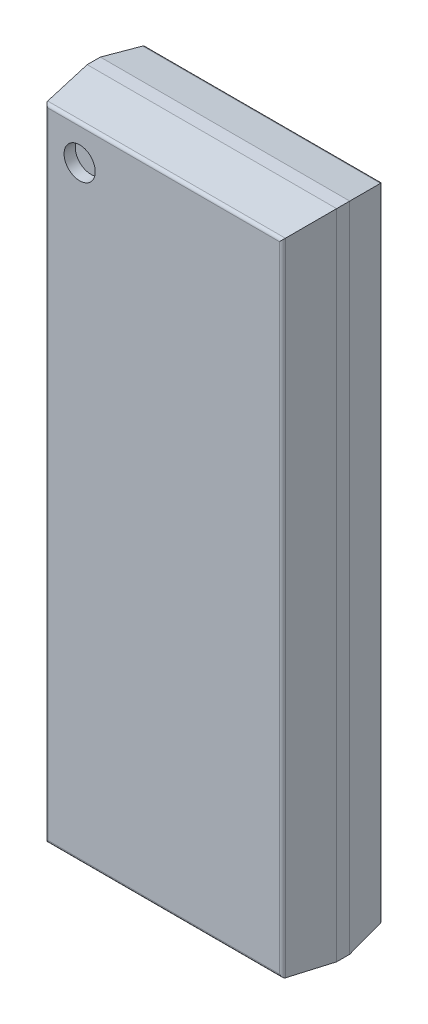
ISO-10303-21;
HEADER;
FILE_DESCRIPTION(('STEP AP214'),'2;1');
FILE_NAME('part.step','',(''),(''),'','','');
FILE_SCHEMA(('AUTOMOTIVE_DESIGN { 1 0 10303 214 1 1 1 1 }'));
ENDSEC;
DATA;
#1=APPLICATION_CONTEXT('core data for automotive mechanical design processes');
#2=APPLICATION_PROTOCOL_DEFINITION('international standard','automotive_design',2000,#1);
#3=PRODUCT_CONTEXT('',#1,'mechanical');
#4=PRODUCT('Part','Part','',(#3));
#5=PRODUCT_RELATED_PRODUCT_CATEGORY('part','',(#4));
#6=PRODUCT_DEFINITION_FORMATION('','',#4);
#7=PRODUCT_DEFINITION_CONTEXT('part definition',#1,'design');
#8=PRODUCT_DEFINITION('design','',#6,#7);
#9=PRODUCT_DEFINITION_SHAPE('','',#8);
#10=(LENGTH_UNIT() NAMED_UNIT(*) SI_UNIT(.MILLI.,.METRE.));
#11=(NAMED_UNIT(*) PLANE_ANGLE_UNIT() SI_UNIT($,.RADIAN.));
#12=(NAMED_UNIT(*) SI_UNIT($,.STERADIAN.) SOLID_ANGLE_UNIT());
#13=UNCERTAINTY_MEASURE_WITH_UNIT(LENGTH_MEASURE(1.E-05),#10,'distance_accuracy_value','');
#14=(GEOMETRIC_REPRESENTATION_CONTEXT(3) GLOBAL_UNCERTAINTY_ASSIGNED_CONTEXT((#13)) GLOBAL_UNIT_ASSIGNED_CONTEXT((#10,
#11,#12)) REPRESENTATION_CONTEXT('',''));
#15=CARTESIAN_POINT('',(0.,0.,0.));
#16=DIRECTION('',(0.,0.,1.));
#17=DIRECTION('',(1.,0.,0.));
#18=AXIS2_PLACEMENT_3D('',#15,#16,#17);
#19=CARTESIAN_POINT('',(-1.315,4.465,1.575));
#20=DIRECTION('',(0.,0.,1.));
#21=DIRECTION('',(1.,0.,0.));
#22=AXIS2_PLACEMENT_3D('',#19,#20,#21);
#23=PLANE('',#22);
#24=CARTESIAN_POINT('',(-1.315,4.465,1.575));
#25=DIRECTION('',(0.,0.,1.));
#26=DIRECTION('',(1.,0.,0.));
#27=AXIS2_PLACEMENT_3D('',#24,#25,#26);
#28=CIRCLE('',#27,0.24375);
#29=CARTESIAN_POINT('',(-1.07125,4.465,1.575));
#30=VERTEX_POINT('',#29);
#31=EDGE_CURVE('E11',#30,#30,#28,.T.);
#32=ORIENTED_EDGE('',*,*,#31,.T.);
#33=EDGE_LOOP('',(#32));
#34=FACE_BOUND('',#33,.T.);
#35=ADVANCED_FACE('F17',(#34),#23,.T.);
#36=CARTESIAN_POINT('',(-1.315,4.465,1.575));
#37=DIRECTION('',(0.,0.,1.));
#38=DIRECTION('',(1.,0.,0.));
#39=AXIS2_PLACEMENT_3D('',#36,#37,#38);
#40=CYLINDRICAL_SURFACE('',#39,0.24375);
#41=DIRECTION('',(0.,0.,1.));
#42=VECTOR('',#41,1.);
#43=CARTESIAN_POINT('',(-1.07125,4.465,1.575));
#44=LINE('',#43,#42);
#45=CARTESIAN_POINT('',(-1.07125,4.465,1.75));
#46=VERTEX_POINT('',#45);
#47=EDGE_CURVE('E20',#30,#46,#44,.T.);
#48=ORIENTED_EDGE('',*,*,#47,.T.);
#49=CARTESIAN_POINT('',(-1.315,4.465,1.75));
#50=DIRECTION('',(0.,0.,1.));
#51=DIRECTION('',(1.,0.,0.));
#52=AXIS2_PLACEMENT_3D('',#49,#50,#51);
#53=CIRCLE('',#52,0.24375);
#54=EDGE_CURVE('E323',#46,#46,#53,.T.);
#55=ORIENTED_EDGE('',*,*,#54,.T.);
#56=ORIENTED_EDGE('',*,*,#47,.F.);
#57=ORIENTED_EDGE('',*,*,#31,.F.);
#58=EDGE_LOOP('',(#48,#55,#56,#57));
#59=FACE_BOUND('',#58,.T.);
#60=ADVANCED_FACE('F570',(#59),#40,.F.);
#61=CARTESIAN_POINT('',(1.808558552786,-5.0025,1.7));
#62=DIRECTION('',(0.,1.,0.));
#63=DIRECTION('',(0.,0.,1.));
#64=AXIS2_PLACEMENT_3D('',#61,#62,#63);
#65=CYLINDRICAL_SURFACE('',#64,0.05);
#66=CARTESIAN_POINT('',(1.808558552786,-4.958558552786,1.7));
#67=DIRECTION('',(-0.707106781186548,-0.707106781186548,0.));
#68=DIRECTION('',(0.707106781186548,-0.707106781186548,0.));
#69=AXIS2_PLACEMENT_3D('',#66,#67,#68);
#70=ELLIPSE('',#69,0.07071067811865,0.05);
#71=CARTESIAN_POINT('',(1.858144342698,-5.008144342698,1.706422572601));
#72=VERTEX_POINT('',#71);
#73=CARTESIAN_POINT('',(1.808558552786,-4.958558552786,1.75));
#74=VERTEX_POINT('',#73);
#75=EDGE_CURVE('E313',#72,#74,#70,.T.);
#76=ORIENTED_EDGE('',*,*,#75,.F.);
#77=DIRECTION('',(0.,1.,0.));
#78=VECTOR('',#77,1.);
#79=CARTESIAN_POINT('',(1.858144342698,-5.0025,1.706422572601));
#80=LINE('',#79,#78);
#81=CARTESIAN_POINT('',(1.858144342698,5.008144342698,1.706422572601));
#82=VERTEX_POINT('',#81);
#83=EDGE_CURVE('E309',#72,#82,#80,.T.);
#84=ORIENTED_EDGE('',*,*,#83,.T.);
#85=CARTESIAN_POINT('',(1.808558552786,4.958558552786,1.7));
#86=DIRECTION('',(-0.707106781186548,0.707106781186548,0.));
#87=DIRECTION('',(0.707106781186548,0.707106781186548,0.));
#88=AXIS2_PLACEMENT_3D('',#85,#86,#87);
#89=ELLIPSE('',#88,0.07071067811865,0.05);
#90=CARTESIAN_POINT('',(1.808558552786,4.958558552786,1.75));
#91=VERTEX_POINT('',#90);
#92=EDGE_CURVE('E325',#91,#82,#89,.T.);
#93=ORIENTED_EDGE('',*,*,#92,.F.);
#94=DIRECTION('',(0.,1.,0.));
#95=VECTOR('',#94,1.);
#96=CARTESIAN_POINT('',(1.808558552786,-5.0025,1.75));
#97=LINE('',#96,#95);
#98=EDGE_CURVE('E270',#74,#91,#97,.T.);
#99=ORIENTED_EDGE('',*,*,#98,.F.);
#100=EDGE_LOOP('',(#76,#84,#93,#99));
#101=FACE_BOUND('',#100,.T.);
#102=ADVANCED_FACE('F562',(#101),#65,.T.);
#103=CARTESIAN_POINT('',(-1.8525,4.958558552786,1.7));
#104=DIRECTION('',(1.,0.,0.));
#105=DIRECTION('',(0.,0.,1.));
#106=AXIS2_PLACEMENT_3D('',#103,#104,#105);
#107=CYLINDRICAL_SURFACE('',#106,0.05);
#108=DIRECTION('',(1.,0.,0.));
#109=VECTOR('',#108,1.);
#110=CARTESIAN_POINT('',(-1.8525,4.958558552786,1.75));
#111=LINE('',#110,#109);
#112=CARTESIAN_POINT('',(-1.808558552786,4.958558552786,1.75));
#113=VERTEX_POINT('',#112);
#114=EDGE_CURVE('E274',#113,#91,#111,.T.);
#115=ORIENTED_EDGE('',*,*,#114,.T.);
#116=ORIENTED_EDGE('',*,*,#92,.T.);
#117=DIRECTION('',(1.,0.,0.));
#118=VECTOR('',#117,1.);
#119=CARTESIAN_POINT('',(-1.8525,5.008144342698,1.706422572601));
#120=LINE('',#119,#118);
#121=CARTESIAN_POINT('',(-1.858144342698,5.008144342698,1.706422572601));
#122=VERTEX_POINT('',#121);
#123=EDGE_CURVE('E301',#122,#82,#120,.T.);
#124=ORIENTED_EDGE('',*,*,#123,.F.);
#125=CARTESIAN_POINT('',(-1.808558552786,4.958558552786,1.7));
#126=DIRECTION('',(0.707106781186548,0.707106781186548,0.));
#127=DIRECTION('',(-0.707106781186548,0.707106781186548,0.));
#128=AXIS2_PLACEMENT_3D('',#125,#126,#127);
#129=ELLIPSE('',#128,0.07071067811865,0.05);
#130=EDGE_CURVE('E297',#122,#113,#129,.T.);
#131=ORIENTED_EDGE('',*,*,#130,.T.);
#132=EDGE_LOOP('',(#115,#116,#124,#131));
#133=FACE_BOUND('',#132,.T.);
#134=ADVANCED_FACE('F551',(#133),#107,.T.);
#135=CARTESIAN_POINT('',(-1.95,-5.1,1.75));
#136=DIRECTION('',(0.,0.,1.));
#137=DIRECTION('',(1.,0.,0.));
#138=AXIS2_PLACEMENT_3D('',#135,#136,#137);
#139=PLANE('',#138);
#140=ORIENTED_EDGE('',*,*,#54,.F.);
#141=EDGE_LOOP('',(#140));
#142=FACE_BOUND('',#141,.T.);
#143=DIRECTION('',(0.,1.,0.));
#144=VECTOR('',#143,1.);
#145=CARTESIAN_POINT('',(-1.808558552786,-5.0025,1.75));
#146=LINE('',#145,#144);
#147=CARTESIAN_POINT('',(-1.808558552786,-4.958558552786,1.75));
#148=VERTEX_POINT('',#147);
#149=EDGE_CURVE('E203',#148,#113,#146,.T.);
#150=ORIENTED_EDGE('',*,*,#149,.F.);
#151=DIRECTION('',(1.,0.,0.));
#152=VECTOR('',#151,1.);
#153=CARTESIAN_POINT('',(-1.8525,-4.958558552786,1.75));
#154=LINE('',#153,#152);
#155=EDGE_CURVE('E275',#148,#74,#154,.T.);
#156=ORIENTED_EDGE('',*,*,#155,.T.);
#157=ORIENTED_EDGE('',*,*,#98,.T.);
#158=ORIENTED_EDGE('',*,*,#114,.F.);
#159=EDGE_LOOP('',(#150,#156,#157,#158));
#160=FACE_BOUND('',#159,.T.);
#161=ADVANCED_FACE('F539',(#142,#160),#139,.T.);
#162=CARTESIAN_POINT('',(-1.8525,-4.958558552786,1.7));
#163=DIRECTION('',(1.,0.,0.));
#164=DIRECTION('',(0.,-0.991715798237691,0.12845145201896));
#165=AXIS2_PLACEMENT_3D('',#162,#163,#164);
#166=CYLINDRICAL_SURFACE('',#165,0.05);
#167=DIRECTION('',(1.,0.,0.));
#168=VECTOR('',#167,1.);
#169=CARTESIAN_POINT('',(-1.8525,-5.008144342698,1.706422572601));
#170=LINE('',#169,#168);
#171=CARTESIAN_POINT('',(-1.858144342698,-5.008144342698,1.706422572601));
#172=VERTEX_POINT('',#171);
#173=EDGE_CURVE('E204',#172,#72,#170,.T.);
#174=ORIENTED_EDGE('',*,*,#173,.T.);
#175=ORIENTED_EDGE('',*,*,#75,.T.);
#176=ORIENTED_EDGE('',*,*,#155,.F.);
#177=CARTESIAN_POINT('',(-1.808558552786,-4.958558552786,1.7));
#178=DIRECTION('',(-0.707106781186548,0.707106781186548,0.));
#179=DIRECTION('',(0.707106781186548,0.707106781186548,0.));
#180=AXIS2_PLACEMENT_3D('',#177,#178,#179);
#181=ELLIPSE('',#180,0.07071067811865,0.05);
#182=EDGE_CURVE('E199',#172,#148,#181,.T.);
#183=ORIENTED_EDGE('',*,*,#182,.F.);
#184=EDGE_LOOP('',(#174,#175,#176,#183));
#185=FACE_BOUND('',#184,.T.);
#186=ADVANCED_FACE('F528',(#185),#166,.T.);
#187=CARTESIAN_POINT('',(1.90125,-5.1,1.373623210137));
#188=DIRECTION('',(0.991715798237691,0.,0.12845145201896));
#189=DIRECTION('',(0.,-1.,0.));
#190=AXIS2_PLACEMENT_3D('',#187,#188,#189);
#191=PLANE('',#190);
#192=DIRECTION('',(-0.12740467794397,0.12740467794397,0.983634127140771));
#193=VECTOR('',#192,1.);
#194=CARTESIAN_POINT('',(1.870389001332,-5.020389001332,1.611887079072));
#195=LINE('',#194,#193);
#196=CARTESIAN_POINT('',(1.95,-5.1,0.997246420274));
#197=VERTEX_POINT('',#196);
#198=EDGE_CURVE('E287',#197,#72,#195,.T.);
#199=ORIENTED_EDGE('',*,*,#198,.F.);
#200=DIRECTION('',(0.,1.,0.));
#201=VECTOR('',#200,1.);
#202=CARTESIAN_POINT('',(1.95,-5.1,0.997246420274));
#203=LINE('',#202,#201);
#204=CARTESIAN_POINT('',(1.95,5.1,0.997246420274));
#205=VERTEX_POINT('',#204);
#206=EDGE_CURVE('E283',#197,#205,#203,.T.);
#207=ORIENTED_EDGE('',*,*,#206,.T.);
#208=DIRECTION('',(-0.12740467794397,-0.12740467794397,0.983634127140771));
#209=VECTOR('',#208,1.);
#210=CARTESIAN_POINT('',(1.787606046326,4.937606046326,2.251016983906));
#211=LINE('',#210,#209);
#212=EDGE_CURVE('E305',#205,#82,#211,.T.);
#213=ORIENTED_EDGE('',*,*,#212,.T.);
#214=ORIENTED_EDGE('',*,*,#83,.F.);
#215=EDGE_LOOP('',(#199,#207,#213,#214));
#216=FACE_BOUND('',#215,.T.);
#217=ADVANCED_FACE('F518',(#216),#191,.T.);
#218=CARTESIAN_POINT('',(-1.95,5.05125,1.373623210137));
#219=DIRECTION('',(0.,0.991715798237691,0.12845145201896));
#220=DIRECTION('',(1.,0.,0.));
#221=AXIS2_PLACEMENT_3D('',#218,#219,#220);
#222=PLANE('',#221);
#223=ORIENTED_EDGE('',*,*,#123,.T.);
#224=ORIENTED_EDGE('',*,*,#212,.F.);
#225=DIRECTION('',(1.,0.,0.));
#226=VECTOR('',#225,1.);
#227=CARTESIAN_POINT('',(-1.95,5.1,0.997246420274));
#228=LINE('',#227,#226);
#229=CARTESIAN_POINT('',(-1.95,5.1,0.997246420274));
#230=VERTEX_POINT('',#229);
#231=EDGE_CURVE('E279',#230,#205,#228,.T.);
#232=ORIENTED_EDGE('',*,*,#231,.F.);
#233=DIRECTION('',(0.12740467794397,-0.12740467794397,0.983634127140771));
#234=VECTOR('',#233,1.);
#235=CARTESIAN_POINT('',(-1.819258352652,4.969258352652,2.006643784999));
#236=LINE('',#235,#234);
#237=EDGE_CURVE('E261',#230,#122,#236,.T.);
#238=ORIENTED_EDGE('',*,*,#237,.T.);
#239=EDGE_LOOP('',(#223,#224,#232,#238));
#240=FACE_BOUND('',#239,.T.);
#241=ADVANCED_FACE('F507',(#240),#222,.T.);
#242=CARTESIAN_POINT('',(-1.808558552786,-5.0025,1.7));
#243=DIRECTION('',(0.,1.,0.));
#244=DIRECTION('',(-0.991715798237691,0.,0.12845145201896));
#245=AXIS2_PLACEMENT_3D('',#242,#243,#244);
#246=CYLINDRICAL_SURFACE('',#245,0.05);
#247=ORIENTED_EDGE('',*,*,#182,.T.);
#248=ORIENTED_EDGE('',*,*,#149,.T.);
#249=ORIENTED_EDGE('',*,*,#130,.F.);
#250=DIRECTION('',(0.,1.,0.));
#251=VECTOR('',#250,1.);
#252=CARTESIAN_POINT('',(-1.858144342698,-5.0025,1.706422572601));
#253=LINE('',#252,#251);
#254=EDGE_CURVE('E257',#172,#122,#253,.T.);
#255=ORIENTED_EDGE('',*,*,#254,.F.);
#256=EDGE_LOOP('',(#247,#248,#249,#255));
#257=FACE_BOUND('',#256,.T.);
#258=ADVANCED_FACE('F497',(#257),#246,.T.);
#259=CARTESIAN_POINT('',(-1.95,-5.05125,1.373623210137));
#260=DIRECTION('',(0.,0.991715798237691,-0.12845145201896));
#261=DIRECTION('',(-1.,0.,0.));
#262=AXIS2_PLACEMENT_3D('',#259,#260,#261);
#263=PLANE('',#262);
#264=DIRECTION('',(0.12740467794397,0.12740467794397,0.983634127140771));
#265=VECTOR('',#264,1.);
#266=CARTESIAN_POINT('',(-1.902041307658,-5.052041307658,1.367513880164));
#267=LINE('',#266,#265);
#268=CARTESIAN_POINT('',(-1.95,-5.1,0.997246420274));
#269=VERTEX_POINT('',#268);
#270=EDGE_CURVE('E265',#269,#172,#267,.T.);
#271=ORIENTED_EDGE('',*,*,#270,.F.);
#272=DIRECTION('',(1.,0.,0.));
#273=VECTOR('',#272,1.);
#274=CARTESIAN_POINT('',(-1.95,-5.1,0.997246420274));
#275=LINE('',#274,#273);
#276=EDGE_CURVE('E149',#269,#197,#275,.T.);
#277=ORIENTED_EDGE('',*,*,#276,.T.);
#278=ORIENTED_EDGE('',*,*,#198,.T.);
#279=ORIENTED_EDGE('',*,*,#173,.F.);
#280=EDGE_LOOP('',(#271,#277,#278,#279));
#281=FACE_BOUND('',#280,.T.);
#282=ADVANCED_FACE('F487',(#281),#263,.F.);
#283=CARTESIAN_POINT('',(1.95,-5.1,0.18));
#284=DIRECTION('',(1.,0.,0.));
#285=DIRECTION('',(0.,1.,0.));
#286=AXIS2_PLACEMENT_3D('',#283,#284,#285);
#287=PLANE('',#286);
#288=DIRECTION('',(0.,0.,1.));
#289=VECTOR('',#288,1.);
#290=CARTESIAN_POINT('',(1.95,-5.1,0.18));
#291=LINE('',#290,#289);
#292=CARTESIAN_POINT('',(1.95,-5.1,0.792246420274));
#293=VERTEX_POINT('',#292);
#294=EDGE_CURVE('E235',#293,#197,#291,.T.);
#295=ORIENTED_EDGE('',*,*,#294,.F.);
#296=DIRECTION('',(0.,1.,0.));
#297=VECTOR('',#296,1.);
#298=CARTESIAN_POINT('',(1.95,-5.1,0.792246420274));
#299=LINE('',#298,#297);
#300=CARTESIAN_POINT('',(1.95,5.1,0.792246420274));
#301=VERTEX_POINT('',#300);
#302=EDGE_CURVE('E242',#293,#301,#299,.T.);
#303=ORIENTED_EDGE('',*,*,#302,.T.);
#304=DIRECTION('',(0.,0.,1.));
#305=VECTOR('',#304,1.);
#306=CARTESIAN_POINT('',(1.95,5.1,0.18));
#307=LINE('',#306,#305);
#308=EDGE_CURVE('E269',#301,#205,#307,.T.);
#309=ORIENTED_EDGE('',*,*,#308,.T.);
#310=ORIENTED_EDGE('',*,*,#206,.F.);
#311=EDGE_LOOP('',(#295,#303,#309,#310));
#312=FACE_BOUND('',#311,.T.);
#313=ADVANCED_FACE('F476',(#312),#287,.T.);
#314=CARTESIAN_POINT('',(1.809832438814,-5.0025,0.23));
#315=DIRECTION('',(0.,1.,0.));
#316=DIRECTION('',(0.,0.,-1.));
#317=AXIS2_PLACEMENT_3D('',#314,#315,#316);
#318=CYLINDRICAL_SURFACE('',#317,0.05);
#319=DIRECTION('',(0.,1.,0.));
#320=VECTOR('',#319,1.);
#321=CARTESIAN_POINT('',(1.809832438814,-5.0025,0.18));
#322=LINE('',#321,#320);
#323=CARTESIAN_POINT('',(1.809832438814,-4.959832438814,0.18));
#324=VERTEX_POINT('',#323);
#325=CARTESIAN_POINT('',(1.809832438814,4.959832438814,0.18));
#326=VERTEX_POINT('',#325);
#327=EDGE_CURVE('E250',#324,#326,#322,.T.);
#328=ORIENTED_EDGE('',*,*,#327,.T.);
#329=CARTESIAN_POINT('',(1.809832438814,4.959832438814,0.23));
#330=DIRECTION('',(0.707106781186548,-0.707106781186548,0.));
#331=DIRECTION('',(0.707106781186548,0.707106781186548,0.));
#332=AXIS2_PLACEMENT_3D('',#329,#330,#331);
#333=ELLIPSE('',#332,0.07071067811865,0.05);
#334=CARTESIAN_POINT('',(1.859210237675,5.009210237675,0.222136605083));
#335=VERTEX_POINT('',#334);
#336=EDGE_CURVE('E254',#326,#335,#333,.T.);
#337=ORIENTED_EDGE('',*,*,#336,.T.);
#338=DIRECTION('',(0.,1.,0.));
#339=VECTOR('',#338,1.);
#340=CARTESIAN_POINT('',(1.859210237675,-5.0025,0.222136605083));
#341=LINE('',#340,#339);
#342=CARTESIAN_POINT('',(1.859210237675,-5.009210237675,0.222136605083));
#343=VERTEX_POINT('',#342);
#344=EDGE_CURVE('E238',#343,#335,#341,.T.);
#345=ORIENTED_EDGE('',*,*,#344,.F.);
#346=CARTESIAN_POINT('',(1.809832438814,-4.959832438814,0.23));
#347=DIRECTION('',(0.707106781186548,0.707106781186548,0.));
#348=DIRECTION('',(0.707106781186548,-0.707106781186548,0.));
#349=AXIS2_PLACEMENT_3D('',#346,#347,#348);
#350=ELLIPSE('',#349,0.07071067811865,0.05);
#351=EDGE_CURVE('E229',#343,#324,#350,.T.);
#352=ORIENTED_EDGE('',*,*,#351,.T.);
#353=EDGE_LOOP('',(#328,#337,#345,#352));
#354=FACE_BOUND('',#353,.T.);
#355=ADVANCED_FACE('F464',(#354),#318,.T.);
#356=CARTESIAN_POINT('',(-1.95,5.1,0.18));
#357=DIRECTION('',(0.,1.,0.));
#358=DIRECTION('',(1.,0.,0.));
#359=AXIS2_PLACEMENT_3D('',#356,#357,#358);
#360=PLANE('',#359);
#361=ORIENTED_EDGE('',*,*,#308,.F.);
#362=DIRECTION('',(1.,0.,0.));
#363=VECTOR('',#362,1.);
#364=CARTESIAN_POINT('',(-1.95,5.1,0.792246420274));
#365=LINE('',#364,#363);
#366=CARTESIAN_POINT('',(-1.95,5.1,0.792246420274));
#367=VERTEX_POINT('',#366);
#368=EDGE_CURVE('E155',#367,#301,#365,.T.);
#369=ORIENTED_EDGE('',*,*,#368,.F.);
#370=DIRECTION('',(0.,0.,1.));
#371=VECTOR('',#370,1.);
#372=CARTESIAN_POINT('',(-1.95,5.1,0.18));
#373=LINE('',#372,#371);
#374=EDGE_CURVE('E156',#367,#230,#373,.T.);
#375=ORIENTED_EDGE('',*,*,#374,.T.);
#376=ORIENTED_EDGE('',*,*,#231,.T.);
#377=EDGE_LOOP('',(#361,#369,#375,#376));
#378=FACE_BOUND('',#377,.T.);
#379=ADVANCED_FACE('F454',(#378),#360,.T.);
#380=CARTESIAN_POINT('',(-1.90125,-5.1,1.373623210137));
#381=DIRECTION('',(0.991715798237691,0.,-0.12845145201896));
#382=DIRECTION('',(0.,-1.,0.));
#383=AXIS2_PLACEMENT_3D('',#380,#381,#382);
#384=PLANE('',#383);
#385=ORIENTED_EDGE('',*,*,#254,.T.);
#386=ORIENTED_EDGE('',*,*,#237,.F.);
#387=DIRECTION('',(0.,1.,0.));
#388=VECTOR('',#387,1.);
#389=CARTESIAN_POINT('',(-1.95,-5.1,0.997246420274));
#390=LINE('',#389,#388);
#391=EDGE_CURVE('E197',#269,#230,#390,.T.);
#392=ORIENTED_EDGE('',*,*,#391,.F.);
#393=ORIENTED_EDGE('',*,*,#270,.T.);
#394=EDGE_LOOP('',(#385,#386,#392,#393));
#395=FACE_BOUND('',#394,.T.);
#396=ADVANCED_FACE('F444',(#395),#384,.F.);
#397=CARTESIAN_POINT('',(-1.8525,4.959832438814,0.23));
#398=DIRECTION('',(1.,0.,0.));
#399=DIRECTION('',(0.,0.,-1.));
#400=AXIS2_PLACEMENT_3D('',#397,#398,#399);
#401=CYLINDRICAL_SURFACE('',#400,0.05);
#402=CARTESIAN_POINT('',(-1.809832438814,4.959832438814,0.23));
#403=DIRECTION('',(-0.707106781186548,-0.707106781186548,0.));
#404=DIRECTION('',(-0.707106781186548,0.707106781186548,0.));
#405=AXIS2_PLACEMENT_3D('',#402,#403,#404);
#406=ELLIPSE('',#405,0.07071067811865,0.05);
#407=CARTESIAN_POINT('',(-1.859210237675,5.009210237675,0.222136605083));
#408=VERTEX_POINT('',#407);
#409=CARTESIAN_POINT('',(-1.809832438814,4.959832438814,0.18));
#410=VERTEX_POINT('',#409);
#411=EDGE_CURVE('E167',#408,#410,#406,.T.);
#412=ORIENTED_EDGE('',*,*,#411,.F.);
#413=DIRECTION('',(1.,0.,0.));
#414=VECTOR('',#413,1.);
#415=CARTESIAN_POINT('',(-1.8525,5.009210237675,0.222136605083));
#416=LINE('',#415,#414);
#417=EDGE_CURVE('E224',#408,#335,#416,.T.);
#418=ORIENTED_EDGE('',*,*,#417,.T.);
#419=ORIENTED_EDGE('',*,*,#336,.F.);
#420=DIRECTION('',(1.,0.,0.));
#421=VECTOR('',#420,1.);
#422=CARTESIAN_POINT('',(-1.8525,4.959832438814,0.18));
#423=LINE('',#422,#421);
#424=EDGE_CURVE('E246',#410,#326,#423,.T.);
#425=ORIENTED_EDGE('',*,*,#424,.F.);
#426=EDGE_LOOP('',(#412,#418,#419,#425));
#427=FACE_BOUND('',#426,.T.);
#428=ADVANCED_FACE('F433',(#427),#401,.T.);
#429=CARTESIAN_POINT('',(-1.95,-5.1,0.18));
#430=DIRECTION('',(0.,0.,1.));
#431=DIRECTION('',(1.,0.,0.));
#432=AXIS2_PLACEMENT_3D('',#429,#430,#431);
#433=PLANE('',#432);
#434=ORIENTED_EDGE('',*,*,#424,.T.);
#435=ORIENTED_EDGE('',*,*,#327,.F.);
#436=DIRECTION('',(1.,0.,0.));
#437=VECTOR('',#436,1.);
#438=CARTESIAN_POINT('',(-1.8525,-4.959832438814,0.18));
#439=LINE('',#438,#437);
#440=CARTESIAN_POINT('',(-1.809832438814,-4.959832438814,0.18));
#441=VERTEX_POINT('',#440);
#442=EDGE_CURVE('E225',#441,#324,#439,.T.);
#443=ORIENTED_EDGE('',*,*,#442,.F.);
#444=DIRECTION('',(0.,1.,0.));
#445=VECTOR('',#444,1.);
#446=CARTESIAN_POINT('',(-1.809832438814,-5.0025,0.18));
#447=LINE('',#446,#445);
#448=EDGE_CURVE('E198',#441,#410,#447,.T.);
#449=ORIENTED_EDGE('',*,*,#448,.T.);
#450=EDGE_LOOP('',(#434,#435,#443,#449));
#451=FACE_BOUND('',#450,.T.);
#452=ADVANCED_FACE('F421',(#451),#433,.F.);
#453=CARTESIAN_POINT('',(1.90125,-5.1,0.486123210137));
#454=DIRECTION('',(-0.987555977225231,0.,0.157267898335037));
#455=DIRECTION('',(0.,1.,0.));
#456=AXIS2_PLACEMENT_3D('',#453,#454,#455);
#457=PLANE('',#456);
#458=ORIENTED_EDGE('',*,*,#344,.T.);
#459=DIRECTION('',(-0.15535837904697,-0.15535837904697,-0.975565245444812));
#460=VECTOR('',#459,1.);
#461=CARTESIAN_POINT('',(1.732266248138,4.882266248138,-0.575001888963));
#462=LINE('',#461,#460);
#463=EDGE_CURVE('E220',#301,#335,#462,.T.);
#464=ORIENTED_EDGE('',*,*,#463,.F.);
#465=ORIENTED_EDGE('',*,*,#302,.F.);
#466=DIRECTION('',(-0.15535837904697,0.15535837904697,-0.975565245444812));
#467=VECTOR('',#466,1.);
#468=CARTESIAN_POINT('',(1.855361000432,-5.005361000432,0.197965510489));
#469=LINE('',#468,#467);
#470=EDGE_CURVE('E165',#293,#343,#469,.T.);
#471=ORIENTED_EDGE('',*,*,#470,.T.);
#472=EDGE_LOOP('',(#458,#464,#465,#471));
#473=FACE_BOUND('',#472,.T.);
#474=ADVANCED_FACE('F411',(#473),#457,.F.);
#475=CARTESIAN_POINT('',(-1.95,-5.1,0.18));
#476=DIRECTION('',(0.,1.,0.));
#477=DIRECTION('',(1.,0.,0.));
#478=AXIS2_PLACEMENT_3D('',#475,#476,#477);
#479=PLANE('',#478);
#480=ORIENTED_EDGE('',*,*,#276,.F.);
#481=DIRECTION('',(0.,0.,1.));
#482=VECTOR('',#481,1.);
#483=CARTESIAN_POINT('',(-1.95,-5.1,0.18));
#484=LINE('',#483,#482);
#485=CARTESIAN_POINT('',(-1.95,-5.1,0.792246420274));
#486=VERTEX_POINT('',#485);
#487=EDGE_CURVE('E142',#486,#269,#484,.T.);
#488=ORIENTED_EDGE('',*,*,#487,.F.);
#489=DIRECTION('',(1.,0.,0.));
#490=VECTOR('',#489,1.);
#491=CARTESIAN_POINT('',(-1.95,-5.1,0.792246420274));
#492=LINE('',#491,#490);
#493=EDGE_CURVE('E146',#486,#293,#492,.T.);
#494=ORIENTED_EDGE('',*,*,#493,.T.);
#495=ORIENTED_EDGE('',*,*,#294,.T.);
#496=EDGE_LOOP('',(#480,#488,#494,#495));
#497=FACE_BOUND('',#496,.T.);
#498=ADVANCED_FACE('F144',(#497),#479,.F.);
#499=CARTESIAN_POINT('',(-1.8525,-4.959832438814,0.23));
#500=DIRECTION('',(1.,0.,0.));
#501=DIRECTION('',(0.,-0.987555977225231,-0.157267898335037));
#502=AXIS2_PLACEMENT_3D('',#499,#500,#501);
#503=CYLINDRICAL_SURFACE('',#502,0.05);
#504=CARTESIAN_POINT('',(-1.809832438814,-4.959832438814,0.23));
#505=DIRECTION('',(0.707106781186548,-0.707106781186548,0.));
#506=DIRECTION('',(0.707106781186548,0.707106781186548,0.));
#507=AXIS2_PLACEMENT_3D('',#504,#505,#506);
#508=ELLIPSE('',#507,0.07071067811865,0.05);
#509=CARTESIAN_POINT('',(-1.859210237675,-5.009210237675,0.222136605083));
#510=VERTEX_POINT('',#509);
#511=EDGE_CURVE('E193',#510,#441,#508,.T.);
#512=ORIENTED_EDGE('',*,*,#511,.T.);
#513=ORIENTED_EDGE('',*,*,#442,.T.);
#514=ORIENTED_EDGE('',*,*,#351,.F.);
#515=DIRECTION('',(1.,0.,0.));
#516=VECTOR('',#515,1.);
#517=CARTESIAN_POINT('',(-1.8525,-5.009210237675,0.222136605083));
#518=LINE('',#517,#516);
#519=EDGE_CURVE('E207',#510,#343,#518,.T.);
#520=ORIENTED_EDGE('',*,*,#519,.F.);
#521=EDGE_LOOP('',(#512,#513,#514,#520));
#522=FACE_BOUND('',#521,.T.);
#523=ADVANCED_FACE('F390',(#522),#503,.T.);
#524=CARTESIAN_POINT('',(-1.95,5.05125,0.486123210137));
#525=DIRECTION('',(0.,-0.987555977225231,0.157267898335037));
#526=DIRECTION('',(-1.,0.,0.));
#527=AXIS2_PLACEMENT_3D('',#524,#525,#526);
#528=PLANE('',#527);
#529=DIRECTION('',(0.15535837904697,-0.15535837904697,-0.975565245444812));
#530=VECTOR('',#529,1.);
#531=CARTESIAN_POINT('',(-1.779331888721,4.929331888721,-0.279455530349));
#532=LINE('',#531,#530);
#533=EDGE_CURVE('E178',#367,#408,#532,.T.);
#534=ORIENTED_EDGE('',*,*,#533,.F.);
#535=ORIENTED_EDGE('',*,*,#368,.T.);
#536=ORIENTED_EDGE('',*,*,#463,.T.);
#537=ORIENTED_EDGE('',*,*,#417,.F.);
#538=EDGE_LOOP('',(#534,#535,#536,#537));
#539=FACE_BOUND('',#538,.T.);
#540=ADVANCED_FACE('F379',(#539),#528,.F.);
#541=CARTESIAN_POINT('',(-1.95,-5.1,0.18));
#542=DIRECTION('',(1.,0.,0.));
#543=DIRECTION('',(0.,1.,0.));
#544=AXIS2_PLACEMENT_3D('',#541,#542,#543);
#545=PLANE('',#544);
#546=ORIENTED_EDGE('',*,*,#391,.T.);
#547=ORIENTED_EDGE('',*,*,#374,.F.);
#548=DIRECTION('',(0.,1.,0.));
#549=VECTOR('',#548,1.);
#550=CARTESIAN_POINT('',(-1.95,-5.1,0.792246420274));
#551=LINE('',#550,#549);
#552=EDGE_CURVE('E171',#486,#367,#551,.T.);
#553=ORIENTED_EDGE('',*,*,#552,.F.);
#554=ORIENTED_EDGE('',*,*,#487,.T.);
#555=EDGE_LOOP('',(#546,#547,#553,#554));
#556=FACE_BOUND('',#555,.T.);
#557=ADVANCED_FACE('F172',(#556),#545,.F.);
#558=CARTESIAN_POINT('',(-1.809832438814,-5.0025,0.23));
#559=DIRECTION('',(0.,1.,0.));
#560=DIRECTION('',(-0.987555977225231,0.,-0.157267898335037));
#561=AXIS2_PLACEMENT_3D('',#558,#559,#560);
#562=CYLINDRICAL_SURFACE('',#561,0.05);
#563=DIRECTION('',(0.,1.,0.));
#564=VECTOR('',#563,1.);
#565=CARTESIAN_POINT('',(-1.859210237675,-5.0025,0.222136605083));
#566=LINE('',#565,#564);
#567=EDGE_CURVE('E183',#510,#408,#566,.T.);
#568=ORIENTED_EDGE('',*,*,#567,.T.);
#569=ORIENTED_EDGE('',*,*,#411,.T.);
#570=ORIENTED_EDGE('',*,*,#448,.F.);
#571=ORIENTED_EDGE('',*,*,#511,.F.);
#572=EDGE_LOOP('',(#568,#569,#570,#571));
#573=FACE_BOUND('',#572,.T.);
#574=ADVANCED_FACE('F356',(#573),#562,.T.);
#575=CARTESIAN_POINT('',(-1.95,-5.05125,0.486123210137));
#576=DIRECTION('',(0.,-0.987555977225231,-0.157267898335037));
#577=DIRECTION('',(0.,0.157267898335037,-0.987555977225231));
#578=AXIS2_PLACEMENT_3D('',#575,#576,#577);
#579=PLANE('',#578);
#580=ORIENTED_EDGE('',*,*,#519,.T.);
#581=ORIENTED_EDGE('',*,*,#470,.F.);
#582=ORIENTED_EDGE('',*,*,#493,.F.);
#583=DIRECTION('',(0.15535837904697,0.15535837904697,-0.975565245444812));
#584=VECTOR('',#583,1.);
#585=CARTESIAN_POINT('',(-1.902426641015,-5.052426641015,0.493511869102));
#586=LINE('',#585,#584);
#587=EDGE_CURVE('E163',#486,#510,#586,.T.);
#588=ORIENTED_EDGE('',*,*,#587,.T.);
#589=EDGE_LOOP('',(#580,#581,#582,#588));
#590=FACE_BOUND('',#589,.T.);
#591=ADVANCED_FACE('F161',(#590),#579,.T.);
#592=CARTESIAN_POINT('',(-1.90125,-5.1,0.486123210137));
#593=DIRECTION('',(-0.987555977225231,0.,-0.157267898335037));
#594=DIRECTION('',(-0.157267898335037,0.,0.987555977225231));
#595=AXIS2_PLACEMENT_3D('',#592,#593,#594);
#596=PLANE('',#595);
#597=ORIENTED_EDGE('',*,*,#587,.F.);
#598=ORIENTED_EDGE('',*,*,#552,.T.);
#599=ORIENTED_EDGE('',*,*,#533,.T.);
#600=ORIENTED_EDGE('',*,*,#567,.F.);
#601=EDGE_LOOP('',(#597,#598,#599,#600));
#602=FACE_BOUND('',#601,.T.);
#603=ADVANCED_FACE('F181',(#602),#596,.T.);
#604=CLOSED_SHELL('',(#35,#60,#102,#134,#161,#186,#217,#241,#258,#282,#313,#355,#379,#396,#428,
#452,#474,#498,#523,#540,#557,#574,#591,#603));
#605=MANIFOLD_SOLID_BREP('B1',#604);
#606=ADVANCED_BREP_SHAPE_REPRESENTATION('',(#18,#605),#14);
#607=SHAPE_DEFINITION_REPRESENTATION(#9,#606);
ENDSEC;
END-ISO-10303-21;
